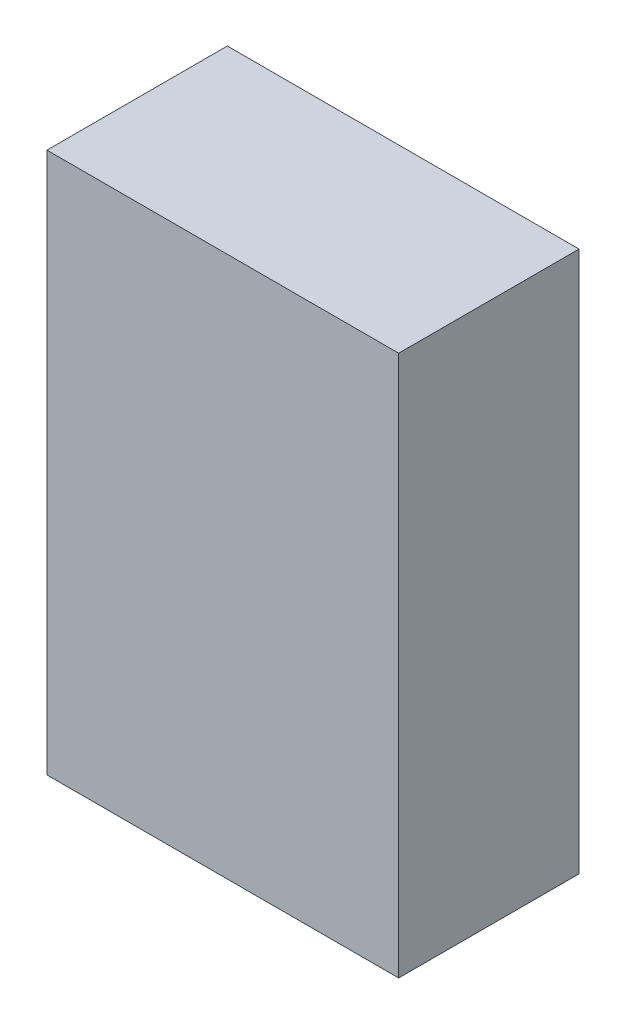
ISO-10303-21;
HEADER;
FILE_DESCRIPTION(('STEP AP214'),'2;1');
FILE_NAME('part.step','',(''),(''),'','','');
FILE_SCHEMA(('AUTOMOTIVE_DESIGN { 1 0 10303 214 1 1 1 1 }'));
ENDSEC;
DATA;
#1=APPLICATION_CONTEXT('core data for automotive mechanical design processes');
#2=APPLICATION_PROTOCOL_DEFINITION('international standard','automotive_design',2000,#1);
#3=PRODUCT_CONTEXT('',#1,'mechanical');
#4=PRODUCT('Part','Part','',(#3));
#5=PRODUCT_RELATED_PRODUCT_CATEGORY('part','',(#4));
#6=PRODUCT_DEFINITION_FORMATION('','',#4);
#7=PRODUCT_DEFINITION_CONTEXT('part definition',#1,'design');
#8=PRODUCT_DEFINITION('design','',#6,#7);
#9=PRODUCT_DEFINITION_SHAPE('','',#8);
#10=(LENGTH_UNIT() NAMED_UNIT(*) SI_UNIT(.MILLI.,.METRE.));
#11=(NAMED_UNIT(*) PLANE_ANGLE_UNIT() SI_UNIT($,.RADIAN.));
#12=(NAMED_UNIT(*) SI_UNIT($,.STERADIAN.) SOLID_ANGLE_UNIT());
#13=UNCERTAINTY_MEASURE_WITH_UNIT(LENGTH_MEASURE(1.E-05),#10,'distance_accuracy_value','');
#14=(GEOMETRIC_REPRESENTATION_CONTEXT(3) GLOBAL_UNCERTAINTY_ASSIGNED_CONTEXT((#13)) GLOBAL_UNIT_ASSIGNED_CONTEXT((#10,
#11,#12)) REPRESENTATION_CONTEXT('',''));
#15=CARTESIAN_POINT('',(0.,0.,0.));
#16=DIRECTION('',(0.,0.,1.));
#17=DIRECTION('',(1.,0.,0.));
#18=AXIS2_PLACEMENT_3D('',#15,#16,#17);
#19=CARTESIAN_POINT('',(-0.97499932,-1.49999954,1.00000054));
#20=DIRECTION('',(0.,0.,1.));
#21=DIRECTION('',(1.,0.,0.));
#22=AXIS2_PLACEMENT_3D('',#19,#20,#21);
#23=PLANE('',#22);
#24=DIRECTION('',(1.,0.,0.));
#25=VECTOR('',#24,1.);
#26=CARTESIAN_POINT('',(-0.97499932,1.49999954,1.00000054));
#27=LINE('',#26,#25);
#28=CARTESIAN_POINT('',(-0.97499932,1.49999954,1.00000054));
#29=VERTEX_POINT('',#28);
#30=CARTESIAN_POINT('',(0.97499932,1.49999954,1.00000054));
#31=VERTEX_POINT('',#30);
#32=EDGE_CURVE('E53',#29,#31,#27,.T.);
#33=ORIENTED_EDGE('',*,*,#32,.F.);
#34=DIRECTION('',(0.,1.,0.));
#35=VECTOR('',#34,1.);
#36=CARTESIAN_POINT('',(-0.97499932,-1.49999954,1.00000054));
#37=LINE('',#36,#35);
#38=CARTESIAN_POINT('',(-0.97499932,-1.49999954,1.00000054));
#39=VERTEX_POINT('',#38);
#40=EDGE_CURVE('E68',#39,#29,#37,.T.);
#41=ORIENTED_EDGE('',*,*,#40,.F.);
#42=DIRECTION('',(1.,0.,0.));
#43=VECTOR('',#42,1.);
#44=CARTESIAN_POINT('',(0.97499932,-1.49999954,1.00000054));
#45=LINE('',#44,#43);
#46=CARTESIAN_POINT('',(0.97499932,-1.49999954,1.00000054));
#47=VERTEX_POINT('',#46);
#48=EDGE_CURVE('E20',#47,#39,#45,.F.);
#49=ORIENTED_EDGE('',*,*,#48,.F.);
#50=DIRECTION('',(0.,1.,0.));
#51=VECTOR('',#50,1.);
#52=CARTESIAN_POINT('',(0.97499932,1.49999954,1.00000054));
#53=LINE('',#52,#51);
#54=EDGE_CURVE('E58',#31,#47,#53,.F.);
#55=ORIENTED_EDGE('',*,*,#54,.F.);
#56=EDGE_LOOP('',(#33,#41,#49,#55));
#57=FACE_BOUND('',#56,.T.);
#58=ADVANCED_FACE('F17',(#57),#23,.T.);
#59=CARTESIAN_POINT('',(0.97499932,-1.49999954,0.));
#60=DIRECTION('',(0.,-1.,0.));
#61=DIRECTION('',(0.,0.,-1.));
#62=AXIS2_PLACEMENT_3D('',#59,#60,#61);
#63=PLANE('',#62);
#64=DIRECTION('',(0.,0.,1.));
#65=VECTOR('',#64,1.);
#66=CARTESIAN_POINT('',(-0.97499932,-1.49999954,0.));
#67=LINE('',#66,#65);
#68=CARTESIAN_POINT('',(-0.97499932,-1.49999954,0.));
#69=VERTEX_POINT('',#68);
#70=EDGE_CURVE('E79',#69,#39,#67,.T.);
#71=ORIENTED_EDGE('',*,*,#70,.F.);
#72=DIRECTION('',(1.,0.,0.));
#73=VECTOR('',#72,1.);
#74=CARTESIAN_POINT('',(-0.97499932,-1.49999954,0.));
#75=LINE('',#74,#73);
#76=CARTESIAN_POINT('',(0.97499932,-1.49999954,0.));
#77=VERTEX_POINT('',#76);
#78=EDGE_CURVE('E74',#69,#77,#75,.T.);
#79=ORIENTED_EDGE('',*,*,#78,.T.);
#80=DIRECTION('',(0.,0.,-1.));
#81=VECTOR('',#80,1.);
#82=CARTESIAN_POINT('',(0.97499932,-1.49999954,0.));
#83=LINE('',#82,#81);
#84=EDGE_CURVE('E63',#47,#77,#83,.T.);
#85=ORIENTED_EDGE('',*,*,#84,.F.);
#86=ORIENTED_EDGE('',*,*,#48,.T.);
#87=EDGE_LOOP('',(#71,#79,#85,#86));
#88=FACE_BOUND('',#87,.T.);
#89=ADVANCED_FACE('F73',(#88),#63,.T.);
#90=CARTESIAN_POINT('',(0.97499932,1.49999954,0.));
#91=DIRECTION('',(1.,0.,0.));
#92=DIRECTION('',(0.,0.,-1.));
#93=AXIS2_PLACEMENT_3D('',#90,#91,#92);
#94=PLANE('',#93);
#95=ORIENTED_EDGE('',*,*,#84,.T.);
#96=DIRECTION('',(0.,1.,0.));
#97=VECTOR('',#96,1.);
#98=CARTESIAN_POINT('',(0.97499932,-1.49999954,0.));
#99=LINE('',#98,#97);
#100=CARTESIAN_POINT('',(0.97499932,1.49999954,0.));
#101=VERTEX_POINT('',#100);
#102=EDGE_CURVE('E84',#77,#101,#99,.T.);
#103=ORIENTED_EDGE('',*,*,#102,.T.);
#104=DIRECTION('',(0.,0.,1.));
#105=VECTOR('',#104,1.);
#106=CARTESIAN_POINT('',(0.97499932,1.49999954,0.));
#107=LINE('',#106,#105);
#108=EDGE_CURVE('E65',#31,#101,#107,.F.);
#109=ORIENTED_EDGE('',*,*,#108,.F.);
#110=ORIENTED_EDGE('',*,*,#54,.T.);
#111=EDGE_LOOP('',(#95,#103,#109,#110));
#112=FACE_BOUND('',#111,.T.);
#113=ADVANCED_FACE('F60',(#112),#94,.T.);
#114=CARTESIAN_POINT('',(-0.97499932,1.49999954,0.));
#115=DIRECTION('',(0.,1.,0.));
#116=DIRECTION('',(0.,0.,1.));
#117=AXIS2_PLACEMENT_3D('',#114,#115,#116);
#118=PLANE('',#117);
#119=ORIENTED_EDGE('',*,*,#108,.T.);
#120=DIRECTION('',(1.,0.,0.));
#121=VECTOR('',#120,1.);
#122=CARTESIAN_POINT('',(-0.97499932,1.49999954,0.));
#123=LINE('',#122,#121);
#124=CARTESIAN_POINT('',(-0.97499932,1.49999954,0.));
#125=VERTEX_POINT('',#124);
#126=EDGE_CURVE('E26',#101,#125,#123,.F.);
#127=ORIENTED_EDGE('',*,*,#126,.T.);
#128=DIRECTION('',(0.,0.,1.));
#129=VECTOR('',#128,1.);
#130=CARTESIAN_POINT('',(-0.97499932,1.49999954,0.));
#131=LINE('',#130,#129);
#132=EDGE_CURVE('E34',#29,#125,#131,.F.);
#133=ORIENTED_EDGE('',*,*,#132,.F.);
#134=ORIENTED_EDGE('',*,*,#32,.T.);
#135=EDGE_LOOP('',(#119,#127,#133,#134));
#136=FACE_BOUND('',#135,.T.);
#137=ADVANCED_FACE('F88',(#136),#118,.T.);
#138=CARTESIAN_POINT('',(-0.97499932,-1.49999954,0.));
#139=DIRECTION('',(-1.,0.,0.));
#140=DIRECTION('',(0.,0.,1.));
#141=AXIS2_PLACEMENT_3D('',#138,#139,#140);
#142=PLANE('',#141);
#143=ORIENTED_EDGE('',*,*,#132,.T.);
#144=DIRECTION('',(0.,1.,0.));
#145=VECTOR('',#144,1.);
#146=CARTESIAN_POINT('',(-0.97499932,-1.49999954,0.));
#147=LINE('',#146,#145);
#148=EDGE_CURVE('E11',#125,#69,#147,.F.);
#149=ORIENTED_EDGE('',*,*,#148,.T.);
#150=ORIENTED_EDGE('',*,*,#70,.T.);
#151=ORIENTED_EDGE('',*,*,#40,.T.);
#152=EDGE_LOOP('',(#143,#149,#150,#151));
#153=FACE_BOUND('',#152,.T.);
#154=ADVANCED_FACE('F91',(#153),#142,.T.);
#155=CARTESIAN_POINT('',(-0.97499932,-1.49999954,0.));
#156=DIRECTION('',(0.,0.,1.));
#157=DIRECTION('',(1.,0.,0.));
#158=AXIS2_PLACEMENT_3D('',#155,#156,#157);
#159=PLANE('',#158);
#160=ORIENTED_EDGE('',*,*,#126,.F.);
#161=ORIENTED_EDGE('',*,*,#102,.F.);
#162=ORIENTED_EDGE('',*,*,#78,.F.);
#163=ORIENTED_EDGE('',*,*,#148,.F.);
#164=EDGE_LOOP('',(#160,#161,#162,#163));
#165=FACE_BOUND('',#164,.T.);
#166=ADVANCED_FACE('F90',(#165),#159,.F.);
#167=CLOSED_SHELL('',(#58,#89,#113,#137,#154,#166));
#168=MANIFOLD_SOLID_BREP('B1',#167);
#169=ADVANCED_BREP_SHAPE_REPRESENTATION('',(#18,#168),#14);
#170=SHAPE_DEFINITION_REPRESENTATION(#9,#169);
ENDSEC;
END-ISO-10303-21;
